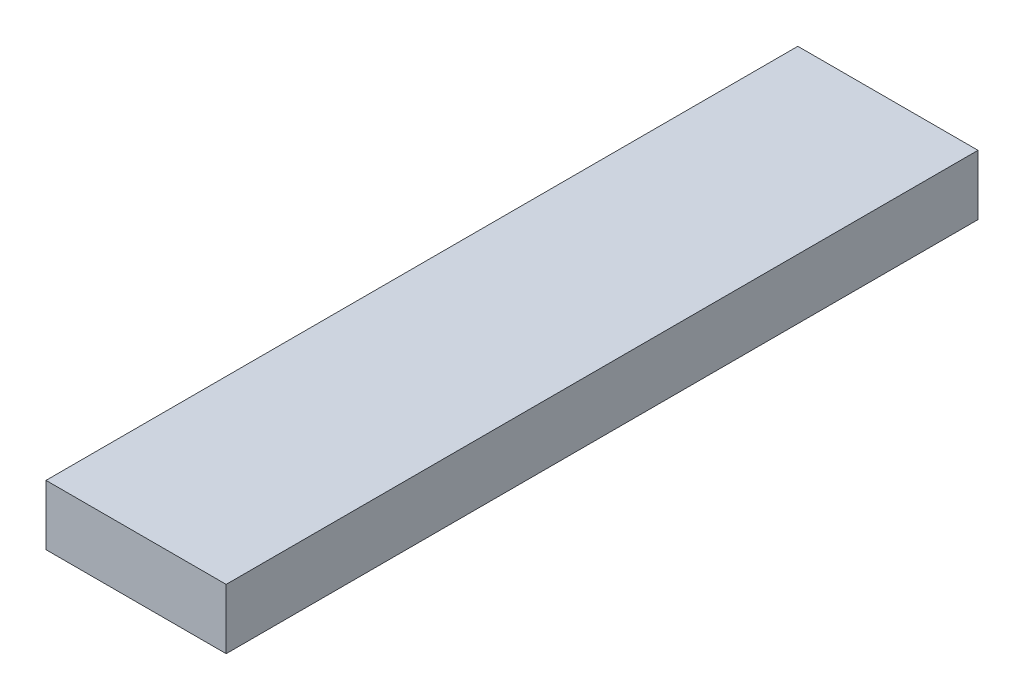
ISO-10303-21;
HEADER;
FILE_DESCRIPTION(('STEP AP214'),'2;1');
FILE_NAME('part.step','',(''),(''),'','','');
FILE_SCHEMA(('AUTOMOTIVE_DESIGN { 1 0 10303 214 1 1 1 1 }'));
ENDSEC;
DATA;
#1=APPLICATION_CONTEXT('core data for automotive mechanical design processes');
#2=APPLICATION_PROTOCOL_DEFINITION('international standard','automotive_design',2000,#1);
#3=PRODUCT_CONTEXT('',#1,'mechanical');
#4=PRODUCT('Part','Part','',(#3));
#5=PRODUCT_RELATED_PRODUCT_CATEGORY('part','',(#4));
#6=PRODUCT_DEFINITION_FORMATION('','',#4);
#7=PRODUCT_DEFINITION_CONTEXT('part definition',#1,'design');
#8=PRODUCT_DEFINITION('design','',#6,#7);
#9=PRODUCT_DEFINITION_SHAPE('','',#8);
#10=(LENGTH_UNIT() NAMED_UNIT(*) SI_UNIT(.MILLI.,.METRE.));
#11=(NAMED_UNIT(*) PLANE_ANGLE_UNIT() SI_UNIT($,.RADIAN.));
#12=(NAMED_UNIT(*) SI_UNIT($,.STERADIAN.) SOLID_ANGLE_UNIT());
#13=UNCERTAINTY_MEASURE_WITH_UNIT(LENGTH_MEASURE(1.E-05),#10,'distance_accuracy_value','');
#14=(GEOMETRIC_REPRESENTATION_CONTEXT(3) GLOBAL_UNCERTAINTY_ASSIGNED_CONTEXT((#13)) GLOBAL_UNIT_ASSIGNED_CONTEXT((#10,
#11,#12)) REPRESENTATION_CONTEXT('',''));
#15=CARTESIAN_POINT('',(0.,0.,0.));
#16=DIRECTION('',(0.,0.,1.));
#17=DIRECTION('',(1.,0.,0.));
#18=AXIS2_PLACEMENT_3D('',#15,#16,#17);
#19=CARTESIAN_POINT('',(0.,0.,159.));
#20=DIRECTION('',(1.,0.,0.));
#21=DIRECTION('',(0.,0.,-1.));
#22=AXIS2_PLACEMENT_3D('',#19,#20,#21);
#23=PLANE('',#22);
#24=DIRECTION('',(0.,-1.,0.));
#25=VECTOR('',#24,1.);
#26=CARTESIAN_POINT('',(0.,0.,0.));
#27=LINE('',#26,#25);
#28=CARTESIAN_POINT('',(0.,12.7,0.));
#29=VERTEX_POINT('',#28);
#30=CARTESIAN_POINT('',(0.,0.,0.));
#31=VERTEX_POINT('',#30);
#32=EDGE_CURVE('E97',#29,#31,#27,.T.);
#33=ORIENTED_EDGE('',*,*,#32,.T.);
#34=DIRECTION('',(0.,0.,-1.));
#35=VECTOR('',#34,1.);
#36=CARTESIAN_POINT('',(0.,0.,159.));
#37=LINE('',#36,#35);
#38=CARTESIAN_POINT('',(0.,0.,159.));
#39=VERTEX_POINT('',#38);
#40=EDGE_CURVE('E11',#39,#31,#37,.T.);
#41=ORIENTED_EDGE('',*,*,#40,.F.);
#42=DIRECTION('',(0.,-1.,0.));
#43=VECTOR('',#42,1.);
#44=CARTESIAN_POINT('',(0.,0.,159.));
#45=LINE('',#44,#43);
#46=CARTESIAN_POINT('',(0.,12.7,159.));
#47=VERTEX_POINT('',#46);
#48=EDGE_CURVE('E85',#47,#39,#45,.T.);
#49=ORIENTED_EDGE('',*,*,#48,.F.);
#50=DIRECTION('',(0.,0.,-1.));
#51=VECTOR('',#50,1.);
#52=CARTESIAN_POINT('',(0.,12.7,159.));
#53=LINE('',#52,#51);
#54=EDGE_CURVE('E93',#47,#29,#53,.T.);
#55=ORIENTED_EDGE('',*,*,#54,.T.);
#56=EDGE_LOOP('',(#33,#41,#49,#55));
#57=FACE_BOUND('',#56,.T.);
#58=ADVANCED_FACE('F34',(#57),#23,.F.);
#59=CARTESIAN_POINT('',(0.,0.,159.));
#60=DIRECTION('',(0.,1.,0.));
#61=DIRECTION('',(0.,0.,1.));
#62=AXIS2_PLACEMENT_3D('',#59,#60,#61);
#63=PLANE('',#62);
#64=DIRECTION('',(1.,0.,0.));
#65=VECTOR('',#64,1.);
#66=CARTESIAN_POINT('',(0.,0.,0.));
#67=LINE('',#66,#65);
#68=CARTESIAN_POINT('',(38.1,0.,0.));
#69=VERTEX_POINT('',#68);
#70=EDGE_CURVE('E89',#31,#69,#67,.T.);
#71=ORIENTED_EDGE('',*,*,#70,.T.);
#72=DIRECTION('',(0.,0.,-1.));
#73=VECTOR('',#72,1.);
#74=CARTESIAN_POINT('',(38.1,0.,159.));
#75=LINE('',#74,#73);
#76=CARTESIAN_POINT('',(38.1,0.,159.));
#77=VERTEX_POINT('',#76);
#78=EDGE_CURVE('E42',#77,#69,#75,.T.);
#79=ORIENTED_EDGE('',*,*,#78,.F.);
#80=DIRECTION('',(1.,0.,0.));
#81=VECTOR('',#80,1.);
#82=CARTESIAN_POINT('',(0.,0.,159.));
#83=LINE('',#82,#81);
#84=EDGE_CURVE('E80',#39,#77,#83,.T.);
#85=ORIENTED_EDGE('',*,*,#84,.F.);
#86=ORIENTED_EDGE('',*,*,#40,.T.);
#87=EDGE_LOOP('',(#71,#79,#85,#86));
#88=FACE_BOUND('',#87,.T.);
#89=ADVANCED_FACE('F88',(#88),#63,.F.);
#90=CARTESIAN_POINT('',(38.1,0.,159.));
#91=DIRECTION('',(-1.,0.,0.));
#92=DIRECTION('',(0.,0.,1.));
#93=AXIS2_PLACEMENT_3D('',#90,#91,#92);
#94=PLANE('',#93);
#95=DIRECTION('',(0.,1.,0.));
#96=VECTOR('',#95,1.);
#97=CARTESIAN_POINT('',(38.1,0.,0.));
#98=LINE('',#97,#96);
#99=CARTESIAN_POINT('',(38.1,12.7,0.));
#100=VERTEX_POINT('',#99);
#101=EDGE_CURVE('E67',#69,#100,#98,.T.);
#102=ORIENTED_EDGE('',*,*,#101,.T.);
#103=DIRECTION('',(0.,0.,-1.));
#104=VECTOR('',#103,1.);
#105=CARTESIAN_POINT('',(38.1,12.7,159.));
#106=LINE('',#105,#104);
#107=CARTESIAN_POINT('',(38.1,12.7,159.));
#108=VERTEX_POINT('',#107);
#109=EDGE_CURVE('E90',#108,#100,#106,.T.);
#110=ORIENTED_EDGE('',*,*,#109,.F.);
#111=DIRECTION('',(0.,1.,0.));
#112=VECTOR('',#111,1.);
#113=CARTESIAN_POINT('',(38.1,0.,159.));
#114=LINE('',#113,#112);
#115=EDGE_CURVE('E83',#77,#108,#114,.T.);
#116=ORIENTED_EDGE('',*,*,#115,.F.);
#117=ORIENTED_EDGE('',*,*,#78,.T.);
#118=EDGE_LOOP('',(#102,#110,#116,#117));
#119=FACE_BOUND('',#118,.T.);
#120=ADVANCED_FACE('F91',(#119),#94,.F.);
#121=CARTESIAN_POINT('',(0.,12.7,159.));
#122=DIRECTION('',(0.,-1.,0.));
#123=DIRECTION('',(0.,0.,-1.));
#124=AXIS2_PLACEMENT_3D('',#121,#122,#123);
#125=PLANE('',#124);
#126=DIRECTION('',(-1.,0.,0.));
#127=VECTOR('',#126,1.);
#128=CARTESIAN_POINT('',(0.,12.7,0.));
#129=LINE('',#128,#127);
#130=EDGE_CURVE('E73',#100,#29,#129,.T.);
#131=ORIENTED_EDGE('',*,*,#130,.T.);
#132=ORIENTED_EDGE('',*,*,#54,.F.);
#133=DIRECTION('',(-1.,0.,0.));
#134=VECTOR('',#133,1.);
#135=CARTESIAN_POINT('',(0.,12.7,159.));
#136=LINE('',#135,#134);
#137=EDGE_CURVE('E50',#108,#47,#136,.T.);
#138=ORIENTED_EDGE('',*,*,#137,.F.);
#139=ORIENTED_EDGE('',*,*,#109,.T.);
#140=EDGE_LOOP('',(#131,#132,#138,#139));
#141=FACE_BOUND('',#140,.T.);
#142=ADVANCED_FACE('F104',(#141),#125,.F.);
#143=CARTESIAN_POINT('',(0.,0.,159.));
#144=DIRECTION('',(0.,0.,-1.));
#145=DIRECTION('',(-1.,0.,0.));
#146=AXIS2_PLACEMENT_3D('',#143,#144,#145);
#147=PLANE('',#146);
#148=ORIENTED_EDGE('',*,*,#48,.T.);
#149=ORIENTED_EDGE('',*,*,#84,.T.);
#150=ORIENTED_EDGE('',*,*,#115,.T.);
#151=ORIENTED_EDGE('',*,*,#137,.T.);
#152=EDGE_LOOP('',(#148,#149,#150,#151));
#153=FACE_BOUND('',#152,.T.);
#154=ADVANCED_FACE('F81',(#153),#147,.F.);
#155=CARTESIAN_POINT('',(0.,0.,0.));
#156=DIRECTION('',(0.,0.,-1.));
#157=DIRECTION('',(-1.,0.,0.));
#158=AXIS2_PLACEMENT_3D('',#155,#156,#157);
#159=PLANE('',#158);
#160=ORIENTED_EDGE('',*,*,#32,.F.);
#161=ORIENTED_EDGE('',*,*,#130,.F.);
#162=ORIENTED_EDGE('',*,*,#101,.F.);
#163=ORIENTED_EDGE('',*,*,#70,.F.);
#164=EDGE_LOOP('',(#160,#161,#162,#163));
#165=FACE_BOUND('',#164,.T.);
#166=ADVANCED_FACE('F107',(#165),#159,.T.);
#167=CLOSED_SHELL('',(#58,#89,#120,#142,#154,#166));
#168=MANIFOLD_SOLID_BREP('B2',#167);
#169=ADVANCED_BREP_SHAPE_REPRESENTATION('',(#18,#168),#14);
#170=SHAPE_DEFINITION_REPRESENTATION(#9,#169);
ENDSEC;
END-ISO-10303-21;
